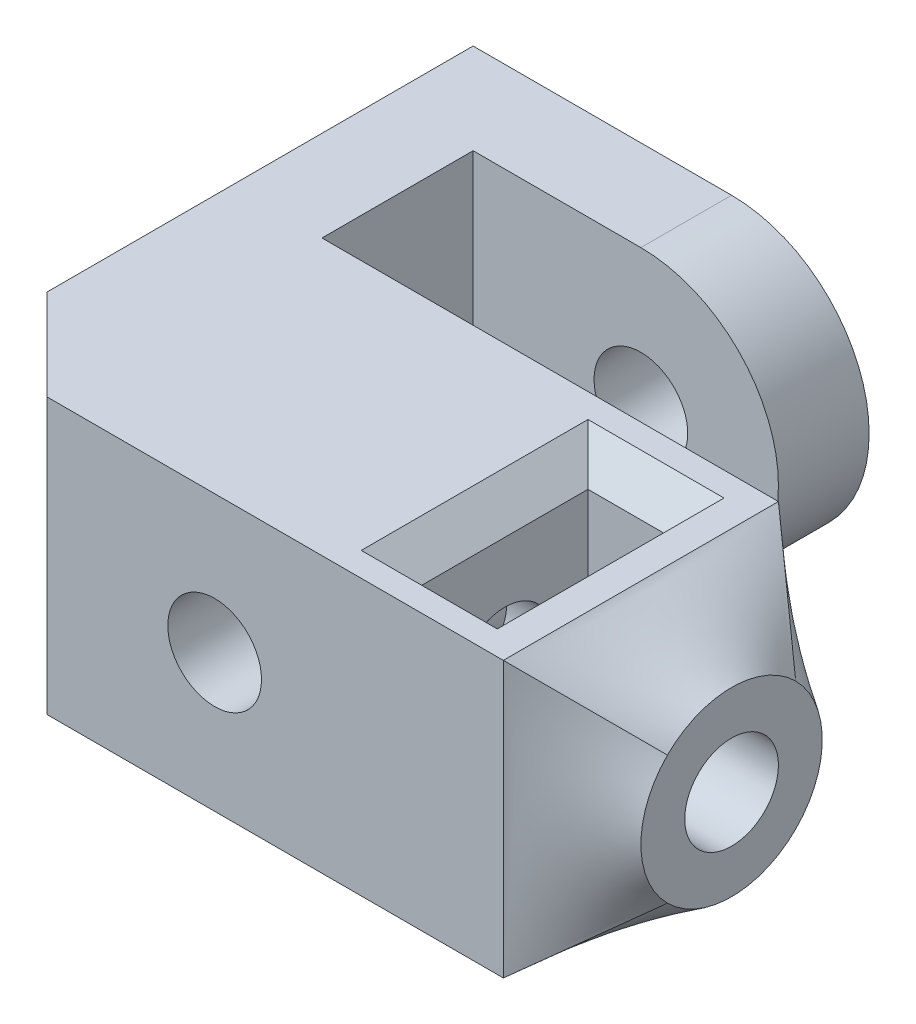
ISO-10303-21;
HEADER;
FILE_DESCRIPTION(('STEP AP214'),'2;1');
FILE_NAME('part.step','',(''),(''),'','','');
FILE_SCHEMA(('AUTOMOTIVE_DESIGN { 1 0 10303 214 1 1 1 1 }'));
ENDSEC;
DATA;
#1=APPLICATION_CONTEXT('core data for automotive mechanical design processes');
#2=APPLICATION_PROTOCOL_DEFINITION('international standard','automotive_design',2000,#1);
#3=PRODUCT_CONTEXT('',#1,'mechanical');
#4=PRODUCT('Part','Part','',(#3));
#5=PRODUCT_RELATED_PRODUCT_CATEGORY('part','',(#4));
#6=PRODUCT_DEFINITION_FORMATION('','',#4);
#7=PRODUCT_DEFINITION_CONTEXT('part definition',#1,'design');
#8=PRODUCT_DEFINITION('design','',#6,#7);
#9=PRODUCT_DEFINITION_SHAPE('','',#8);
#10=(LENGTH_UNIT() NAMED_UNIT(*) SI_UNIT(.MILLI.,.METRE.));
#11=(NAMED_UNIT(*) PLANE_ANGLE_UNIT() SI_UNIT($,.RADIAN.));
#12=(NAMED_UNIT(*) SI_UNIT($,.STERADIAN.) SOLID_ANGLE_UNIT());
#13=UNCERTAINTY_MEASURE_WITH_UNIT(LENGTH_MEASURE(1.E-05),#10,'distance_accuracy_value','');
#14=(GEOMETRIC_REPRESENTATION_CONTEXT(3) GLOBAL_UNCERTAINTY_ASSIGNED_CONTEXT((#13)) GLOBAL_UNIT_ASSIGNED_CONTEXT((#10,
#11,#12)) REPRESENTATION_CONTEXT('',''));
#15=CARTESIAN_POINT('',(0.,0.,0.));
#16=DIRECTION('',(0.,0.,1.));
#17=DIRECTION('',(1.,0.,0.));
#18=AXIS2_PLACEMENT_3D('',#15,#16,#17);
#19=CARTESIAN_POINT('',(-107.11518965689,2.50000000001586,4.55));
#20=DIRECTION('',(1.,0.,0.));
#21=DIRECTION('',(0.,0.,-1.));
#22=AXIS2_PLACEMENT_3D('',#19,#20,#21);
#23=CYLINDRICAL_SURFACE('',#22,1.55);
#24=CARTESIAN_POINT('',(-82.0141896568897,2.50000000001586,4.55));
#25=DIRECTION('',(1.,0.,0.));
#26=DIRECTION('',(0.,0.,-1.));
#27=AXIS2_PLACEMENT_3D('',#24,#25,#26);
#28=CIRCLE('',#27,1.55);
#29=CARTESIAN_POINT('',(-82.0141896568897,2.50000000001586,3.));
#30=VERTEX_POINT('',#29);
#31=EDGE_CURVE('E212',#30,#30,#28,.T.);
#32=ORIENTED_EDGE('',*,*,#31,.T.);
#33=EDGE_LOOP('',(#32));
#34=FACE_BOUND('',#33,.T.);
#35=CARTESIAN_POINT('',(-87.0141896568897,2.50000000001586,4.55));
#36=DIRECTION('',(-1.,0.,0.));
#37=DIRECTION('',(0.,0.,1.));
#38=AXIS2_PLACEMENT_3D('',#35,#36,#37);
#39=CIRCLE('',#38,1.55);
#40=CARTESIAN_POINT('',(-87.0141896568897,2.50000000001586,6.1));
#41=VERTEX_POINT('',#40);
#42=EDGE_CURVE('E289',#41,#41,#39,.T.);
#43=ORIENTED_EDGE('',*,*,#42,.T.);
#44=EDGE_LOOP('',(#43));
#45=FACE_BOUND('',#44,.T.);
#46=ADVANCED_FACE('F64',(#34,#45),#23,.F.);
#47=CARTESIAN_POINT('',(-100.11418965689,0.,0.));
#48=DIRECTION('',(-1.,0.,0.));
#49=DIRECTION('',(0.,0.,1.));
#50=AXIS2_PLACEMENT_3D('',#47,#48,#49);
#51=PLANE('',#50);
#52=DIRECTION('',(0.,1.,0.));
#53=VECTOR('',#52,1.);
#54=CARTESIAN_POINT('',(-100.11418965689,0.,-5.));
#55=LINE('',#54,#53);
#56=CARTESIAN_POINT('',(-100.11418965689,-2.04999999998414,-5.));
#57=VERTEX_POINT('',#56);
#58=CARTESIAN_POINT('',(-100.11418965689,7.05000000001586,-5.));
#59=VERTEX_POINT('',#58);
#60=EDGE_CURVE('E590',#57,#59,#55,.T.);
#61=ORIENTED_EDGE('',*,*,#60,.T.);
#62=DIRECTION('',(0.,0.,-1.));
#63=VECTOR('',#62,1.);
#64=CARTESIAN_POINT('',(-100.11418965689,7.05000000001586,-8.));
#65=LINE('',#64,#63);
#66=CARTESIAN_POINT('',(-100.11418965689,7.05000000001586,0.));
#67=VERTEX_POINT('',#66);
#68=EDGE_CURVE('E356',#67,#59,#65,.T.);
#69=ORIENTED_EDGE('',*,*,#68,.F.);
#70=DIRECTION('',(0.,-1.,0.));
#71=VECTOR('',#70,1.);
#72=CARTESIAN_POINT('',(-100.11418965689,0.,0.));
#73=LINE('',#72,#71);
#74=CARTESIAN_POINT('',(-100.11418965689,-2.04999999998414,0.));
#75=VERTEX_POINT('',#74);
#76=EDGE_CURVE('E544',#67,#75,#73,.T.);
#77=ORIENTED_EDGE('',*,*,#76,.T.);
#78=DIRECTION('',(0.,0.,1.));
#79=VECTOR('',#78,1.);
#80=CARTESIAN_POINT('',(-100.11418965689,-2.04999999998414,-8.));
#81=LINE('',#80,#79);
#82=EDGE_CURVE('E353',#57,#75,#81,.T.);
#83=ORIENTED_EDGE('',*,*,#82,.F.);
#84=EDGE_LOOP('',(#61,#69,#77,#83));
#85=FACE_BOUND('',#84,.T.);
#86=ADVANCED_FACE('F261',(#85),#51,.F.);
#87=CARTESIAN_POINT('',(0.,7.05000000001583,9.1));
#88=DIRECTION('',(0.,1.,0.));
#89=DIRECTION('',(-1.,0.,0.));
#90=AXIS2_PLACEMENT_3D('',#87,#88,#89);
#91=PLANE('',#90);
#92=DIRECTION('',(0.,0.,-1.));
#93=VECTOR('',#92,1.);
#94=CARTESIAN_POINT('',(-90.5141896568897,7.05000000001586,1.79999999999998));
#95=LINE('',#94,#93);
#96=CARTESIAN_POINT('',(-90.5141896568897,7.05000000001586,8.30000000000002));
#97=VERTEX_POINT('',#96);
#98=CARTESIAN_POINT('',(-90.5141896568897,7.05000000001586,0.799999999999976));
#99=VERTEX_POINT('',#98);
#100=EDGE_CURVE('E368',#97,#99,#95,.T.);
#101=ORIENTED_EDGE('',*,*,#100,.T.);
#102=DIRECTION('',(1.,0.,0.));
#103=VECTOR('',#102,1.);
#104=CARTESIAN_POINT('',(0.,7.05000000001583,0.799999999999976));
#105=LINE('',#104,#103);
#106=CARTESIAN_POINT('',(-86.0141896568897,7.05000000001586,0.799999999999976));
#107=VERTEX_POINT('',#106);
#108=EDGE_CURVE('E313',#99,#107,#105,.T.);
#109=ORIENTED_EDGE('',*,*,#108,.T.);
#110=DIRECTION('',(0.,0.,1.));
#111=VECTOR('',#110,1.);
#112=CARTESIAN_POINT('',(-86.0141896568897,7.05000000001586,9.1));
#113=LINE('',#112,#111);
#114=CARTESIAN_POINT('',(-86.0141896568897,7.05000000001586,8.30000000000002));
#115=VERTEX_POINT('',#114);
#116=EDGE_CURVE('E381',#107,#115,#113,.T.);
#117=ORIENTED_EDGE('',*,*,#116,.T.);
#118=DIRECTION('',(-1.,0.,0.));
#119=VECTOR('',#118,1.);
#120=CARTESIAN_POINT('',(0.,7.05000000001583,8.30000000000002));
#121=LINE('',#120,#119);
#122=EDGE_CURVE('E379',#115,#97,#121,.T.);
#123=ORIENTED_EDGE('',*,*,#122,.T.);
#124=EDGE_LOOP('',(#101,#109,#117,#123));
#125=FACE_BOUND('',#124,.T.);
#126=DIRECTION('',(0.,0.,-1.));
#127=VECTOR('',#126,1.);
#128=CARTESIAN_POINT('',(-103.11418965689,7.05000000001586,-8.));
#129=LINE('',#128,#127);
#130=CARTESIAN_POINT('',(-103.11418965689,7.05000000001586,6.09999999999998));
#131=VERTEX_POINT('',#130);
#132=CARTESIAN_POINT('',(-103.11418965689,7.05000000001586,-8.));
#133=VERTEX_POINT('',#132);
#134=EDGE_CURVE('E334',#131,#133,#129,.T.);
#135=ORIENTED_EDGE('',*,*,#134,.F.);
#136=DIRECTION('',(-0.707106781186548,0.,-0.707106781186547));
#137=VECTOR('',#136,1.);
#138=CARTESIAN_POINT('',(-50.0570948284447,7.05000000001585,59.1570948284448));
#139=LINE('',#138,#137);
#140=CARTESIAN_POINT('',(-100.11418965689,7.05000000001587,9.1));
#141=VERTEX_POINT('',#140);
#142=EDGE_CURVE('E86',#131,#141,#139,.F.);
#143=ORIENTED_EDGE('',*,*,#142,.T.);
#144=DIRECTION('',(1.,0.,0.));
#145=VECTOR('',#144,1.);
#146=CARTESIAN_POINT('',(0.,7.05000000001583,9.1));
#147=LINE('',#146,#145);
#148=CARTESIAN_POINT('',(-85.0141896568897,7.05000000001586,9.1));
#149=VERTEX_POINT('',#148);
#150=EDGE_CURVE('E360',#141,#149,#147,.T.);
#151=ORIENTED_EDGE('',*,*,#150,.T.);
#152=DIRECTION('',(0.,0.,1.));
#153=VECTOR('',#152,1.);
#154=CARTESIAN_POINT('',(-85.0141896568897,7.05000000001586,9.1));
#155=LINE('',#154,#153);
#156=CARTESIAN_POINT('',(-85.0141896568897,7.05000000001586,0.));
#157=VERTEX_POINT('',#156);
#158=EDGE_CURVE('E369',#149,#157,#155,.F.);
#159=ORIENTED_EDGE('',*,*,#158,.T.);
#160=DIRECTION('',(1.,0.,0.));
#161=VECTOR('',#160,1.);
#162=CARTESIAN_POINT('',(0.,7.05000000001583,0.));
#163=LINE('',#162,#161);
#164=EDGE_CURVE('E549',#67,#157,#163,.T.);
#165=ORIENTED_EDGE('',*,*,#164,.F.);
#166=ORIENTED_EDGE('',*,*,#68,.T.);
#167=DIRECTION('',(1.,0.,0.));
#168=VECTOR('',#167,1.);
#169=CARTESIAN_POINT('',(0.,7.05000000001586,-5.));
#170=LINE('',#169,#168);
#171=CARTESIAN_POINT('',(-94.5641896568897,7.05000000001586,-5.));
#172=VERTEX_POINT('',#171);
#173=EDGE_CURVE('E583',#59,#172,#170,.T.);
#174=ORIENTED_EDGE('',*,*,#173,.T.);
#175=DIRECTION('',(0.,0.,1.));
#176=VECTOR('',#175,1.);
#177=CARTESIAN_POINT('',(-94.5641896568897,7.05000000001586,-8.));
#178=LINE('',#177,#176);
#179=CARTESIAN_POINT('',(-94.5641896568897,7.05000000001586,-8.));
#180=VERTEX_POINT('',#179);
#181=EDGE_CURVE('E357',#180,#172,#178,.T.);
#182=ORIENTED_EDGE('',*,*,#181,.F.);
#183=DIRECTION('',(1.,0.,0.));
#184=VECTOR('',#183,1.);
#185=CARTESIAN_POINT('',(-103.11418965689,7.05000000001586,-8.));
#186=LINE('',#185,#184);
#187=EDGE_CURVE('E340',#133,#180,#186,.T.);
#188=ORIENTED_EDGE('',*,*,#187,.F.);
#189=EDGE_LOOP('',(#135,#143,#151,#159,#165,#166,#174,#182,#188));
#190=FACE_BOUND('',#189,.T.);
#191=ADVANCED_FACE('F266',(#125,#190),#91,.T.);
#192=CARTESIAN_POINT('',(0.,-2.04999999998411,9.1));
#193=DIRECTION('',(0.,1.,0.));
#194=DIRECTION('',(-1.,0.,0.));
#195=AXIS2_PLACEMENT_3D('',#192,#193,#194);
#196=PLANE('',#195);
#197=DIRECTION('',(1.,0.,0.));
#198=VECTOR('',#197,1.);
#199=CARTESIAN_POINT('',(0.,-2.04999999998411,9.1));
#200=LINE('',#199,#198);
#201=CARTESIAN_POINT('',(-100.11418965689,-2.04999999998414,9.1));
#202=VERTEX_POINT('',#201);
#203=CARTESIAN_POINT('',(-85.0141896568897,-2.04999999998414,9.1));
#204=VERTEX_POINT('',#203);
#205=EDGE_CURVE('E362',#202,#204,#200,.T.);
#206=ORIENTED_EDGE('',*,*,#205,.F.);
#207=DIRECTION('',(0.707106781186548,0.,0.707106781186547));
#208=VECTOR('',#207,1.);
#209=CARTESIAN_POINT('',(-103.11418965689,-2.04999999998414,6.09999999999999));
#210=LINE('',#209,#208);
#211=CARTESIAN_POINT('',(-103.11418965689,-2.04999999998414,6.09999999999999));
#212=VERTEX_POINT('',#211);
#213=EDGE_CURVE('E13',#202,#212,#210,.F.);
#214=ORIENTED_EDGE('',*,*,#213,.T.);
#215=DIRECTION('',(0.,0.,1.));
#216=VECTOR('',#215,1.);
#217=CARTESIAN_POINT('',(-103.11418965689,-2.04999999998414,-8.));
#218=LINE('',#217,#216);
#219=CARTESIAN_POINT('',(-103.11418965689,-2.04999999998414,-8.));
#220=VERTEX_POINT('',#219);
#221=EDGE_CURVE('E336',#220,#212,#218,.T.);
#222=ORIENTED_EDGE('',*,*,#221,.F.);
#223=DIRECTION('',(1.,0.,0.));
#224=VECTOR('',#223,1.);
#225=CARTESIAN_POINT('',(-103.11418965689,-2.04999999998414,-8.));
#226=LINE('',#225,#224);
#227=CARTESIAN_POINT('',(-94.5641896568897,-2.04999999998414,-8.));
#228=VERTEX_POINT('',#227);
#229=EDGE_CURVE('E343',#220,#228,#226,.T.);
#230=ORIENTED_EDGE('',*,*,#229,.T.);
#231=DIRECTION('',(0.,0.,1.));
#232=VECTOR('',#231,1.);
#233=CARTESIAN_POINT('',(-94.5641896568897,-2.04999999998414,-8.));
#234=LINE('',#233,#232);
#235=CARTESIAN_POINT('',(-94.5641896568897,-2.04999999998414,-5.));
#236=VERTEX_POINT('',#235);
#237=EDGE_CURVE('E582',#228,#236,#234,.T.);
#238=ORIENTED_EDGE('',*,*,#237,.T.);
#239=DIRECTION('',(-1.,0.,0.));
#240=VECTOR('',#239,1.);
#241=CARTESIAN_POINT('',(0.,-2.04999999998414,-5.));
#242=LINE('',#241,#240);
#243=EDGE_CURVE('E588',#236,#57,#242,.T.);
#244=ORIENTED_EDGE('',*,*,#243,.T.);
#245=ORIENTED_EDGE('',*,*,#82,.T.);
#246=DIRECTION('',(1.,0.,0.));
#247=VECTOR('',#246,1.);
#248=CARTESIAN_POINT('',(0.,-2.04999999998411,0.));
#249=LINE('',#248,#247);
#250=CARTESIAN_POINT('',(-85.0141896568897,-2.04999999998414,0.));
#251=VERTEX_POINT('',#250);
#252=EDGE_CURVE('E372',#75,#251,#249,.T.);
#253=ORIENTED_EDGE('',*,*,#252,.T.);
#254=DIRECTION('',(0.,0.,1.));
#255=VECTOR('',#254,1.);
#256=CARTESIAN_POINT('',(-85.0141896568897,-2.04999999998414,9.1));
#257=LINE('',#256,#255);
#258=EDGE_CURVE('E366',#204,#251,#257,.F.);
#259=ORIENTED_EDGE('',*,*,#258,.F.);
#260=EDGE_LOOP('',(#206,#214,#222,#230,#238,#244,#245,#253,#259));
#261=FACE_BOUND('',#260,.T.);
#262=ADVANCED_FACE('F407',(#261),#196,.F.);
#263=CARTESIAN_POINT('',(-94.5641896568897,2.50000000001586,9.1));
#264=DIRECTION('',(0.,0.,-1.));
#265=DIRECTION('',(-1.,0.,0.));
#266=AXIS2_PLACEMENT_3D('',#263,#264,#265);
#267=CYLINDRICAL_SURFACE('',#266,1.54999999999998);
#268=CARTESIAN_POINT('',(-94.5641896568897,2.50000000001586,9.1));
#269=DIRECTION('',(0.,0.,1.));
#270=DIRECTION('',(1.,0.,0.));
#271=AXIS2_PLACEMENT_3D('',#268,#269,#270);
#272=CIRCLE('',#271,1.54999999999998);
#273=CARTESIAN_POINT('',(-93.0141896568897,2.50000000001586,9.1));
#274=VERTEX_POINT('',#273);
#275=EDGE_CURVE('E375',#274,#274,#272,.T.);
#276=ORIENTED_EDGE('',*,*,#275,.T.);
#277=EDGE_LOOP('',(#276));
#278=FACE_BOUND('',#277,.T.);
#279=CARTESIAN_POINT('',(-94.5641896568897,2.50000000001586,0.));
#280=DIRECTION('',(0.,0.,1.));
#281=DIRECTION('',(1.,0.,0.));
#282=AXIS2_PLACEMENT_3D('',#279,#280,#281);
#283=CIRCLE('',#282,1.54999999999998);
#284=CARTESIAN_POINT('',(-93.0141896568897,2.50000000001586,0.));
#285=VERTEX_POINT('',#284);
#286=EDGE_CURVE('E363',#285,#285,#283,.T.);
#287=ORIENTED_EDGE('',*,*,#286,.F.);
#288=EDGE_LOOP('',(#287));
#289=FACE_BOUND('',#288,.T.);
#290=ADVANCED_FACE('F410',(#278,#289),#267,.F.);
#291=CARTESIAN_POINT('',(0.,0.,9.1));
#292=DIRECTION('',(0.,0.,1.));
#293=DIRECTION('',(1.,0.,0.));
#294=AXIS2_PLACEMENT_3D('',#291,#292,#293);
#295=PLANE('',#294);
#296=ORIENTED_EDGE('',*,*,#150,.F.);
#297=DIRECTION('',(0.,-1.,0.));
#298=VECTOR('',#297,1.);
#299=CARTESIAN_POINT('',(-100.11418965689,0.,9.1));
#300=LINE('',#299,#298);
#301=EDGE_CURVE('E72',#141,#202,#300,.T.);
#302=ORIENTED_EDGE('',*,*,#301,.T.);
#303=ORIENTED_EDGE('',*,*,#205,.T.);
#304=DIRECTION('',(0.,1.,0.));
#305=VECTOR('',#304,1.);
#306=CARTESIAN_POINT('',(-85.0141896568897,0.,9.1));
#307=LINE('',#306,#305);
#308=EDGE_CURVE('E365',#204,#149,#307,.T.);
#309=ORIENTED_EDGE('',*,*,#308,.T.);
#310=EDGE_LOOP('',(#296,#302,#303,#309));
#311=FACE_BOUND('',#310,.T.);
#312=ORIENTED_EDGE('',*,*,#275,.F.);
#313=EDGE_LOOP('',(#312));
#314=FACE_BOUND('',#313,.T.);
#315=ADVANCED_FACE('F414',(#311,#314),#295,.T.);
#316=CARTESIAN_POINT('',(0.,0.,0.));
#317=DIRECTION('',(0.,0.,1.));
#318=DIRECTION('',(1.,0.,0.));
#319=AXIS2_PLACEMENT_3D('',#316,#317,#318);
#320=PLANE('',#319);
#321=ORIENTED_EDGE('',*,*,#164,.T.);
#322=DIRECTION('',(0.,1.,0.));
#323=VECTOR('',#322,1.);
#324=CARTESIAN_POINT('',(-85.0141896568897,0.,0.));
#325=LINE('',#324,#323);
#326=EDGE_CURVE('E370',#251,#157,#325,.T.);
#327=ORIENTED_EDGE('',*,*,#326,.F.);
#328=ORIENTED_EDGE('',*,*,#252,.F.);
#329=ORIENTED_EDGE('',*,*,#76,.F.);
#330=EDGE_LOOP('',(#321,#327,#328,#329));
#331=FACE_BOUND('',#330,.T.);
#332=ORIENTED_EDGE('',*,*,#286,.T.);
#333=EDGE_LOOP('',(#332));
#334=FACE_BOUND('',#333,.T.);
#335=ADVANCED_FACE('F416',(#331,#334),#320,.F.);
#336=CARTESIAN_POINT('',(-103.11418965689,7.05000000001586,-8.));
#337=DIRECTION('',(0.,0.,1.));
#338=DIRECTION('',(0.,-1.,0.));
#339=AXIS2_PLACEMENT_3D('',#336,#337,#338);
#340=PLANE('',#339);
#341=ORIENTED_EDGE('',*,*,#187,.T.);
#342=CARTESIAN_POINT('',(-94.5641896568897,2.50000000001586,-8.));
#343=DIRECTION('',(0.,0.,-1.));
#344=DIRECTION('',(-1.,0.,0.));
#345=AXIS2_PLACEMENT_3D('',#342,#343,#344);
#346=CIRCLE('',#345,4.55);
#347=EDGE_CURVE('E570',#180,#228,#346,.T.);
#348=ORIENTED_EDGE('',*,*,#347,.T.);
#349=ORIENTED_EDGE('',*,*,#229,.F.);
#350=DIRECTION('',(0.,-1.,0.));
#351=VECTOR('',#350,1.);
#352=CARTESIAN_POINT('',(-103.11418965689,7.05000000001586,-8.));
#353=LINE('',#352,#351);
#354=EDGE_CURVE('E345',#133,#220,#353,.T.);
#355=ORIENTED_EDGE('',*,*,#354,.F.);
#356=EDGE_LOOP('',(#341,#348,#349,#355));
#357=FACE_BOUND('',#356,.T.);
#358=CARTESIAN_POINT('',(-94.5641896568897,2.50000000001586,-8.));
#359=DIRECTION('',(0.,0.,-1.));
#360=DIRECTION('',(-1.,0.,0.));
#361=AXIS2_PLACEMENT_3D('',#358,#359,#360);
#362=CIRCLE('',#361,1.54999999999998);
#363=CARTESIAN_POINT('',(-96.1141896568897,2.50000000001586,-8.));
#364=VERTEX_POINT('',#363);
#365=EDGE_CURVE('E578',#364,#364,#362,.T.);
#366=ORIENTED_EDGE('',*,*,#365,.F.);
#367=EDGE_LOOP('',(#366));
#368=FACE_BOUND('',#367,.T.);
#369=ADVANCED_FACE('F419',(#357,#368),#340,.F.);
#370=CARTESIAN_POINT('',(-103.11418965689,0.,0.));
#371=DIRECTION('',(-1.,0.,0.));
#372=DIRECTION('',(0.,0.,1.));
#373=AXIS2_PLACEMENT_3D('',#370,#371,#372);
#374=PLANE('',#373);
#375=ORIENTED_EDGE('',*,*,#221,.T.);
#376=DIRECTION('',(0.,1.,0.));
#377=VECTOR('',#376,1.);
#378=CARTESIAN_POINT('',(-103.11418965689,0.,6.09999999999999));
#379=LINE('',#378,#377);
#380=EDGE_CURVE('E318',#212,#131,#379,.T.);
#381=ORIENTED_EDGE('',*,*,#380,.T.);
#382=ORIENTED_EDGE('',*,*,#134,.T.);
#383=ORIENTED_EDGE('',*,*,#354,.T.);
#384=EDGE_LOOP('',(#375,#381,#382,#383));
#385=FACE_BOUND('',#384,.T.);
#386=ADVANCED_FACE('F332',(#385),#374,.T.);
#387=CARTESIAN_POINT('',(-94.5641896568897,2.50000000001586,-8.));
#388=DIRECTION('',(0.,0.,1.));
#389=DIRECTION('',(1.,0.,0.));
#390=AXIS2_PLACEMENT_3D('',#387,#388,#389);
#391=CYLINDRICAL_SURFACE('',#390,4.55);
#392=CARTESIAN_POINT('',(-94.5641896568897,2.50000000001586,-5.));
#393=DIRECTION('',(0.,0.,-1.));
#394=DIRECTION('',(-1.,0.,0.));
#395=AXIS2_PLACEMENT_3D('',#392,#393,#394);
#396=CIRCLE('',#395,4.55);
#397=EDGE_CURVE('E586',#172,#236,#396,.T.);
#398=ORIENTED_EDGE('',*,*,#397,.T.);
#399=ORIENTED_EDGE('',*,*,#237,.F.);
#400=ORIENTED_EDGE('',*,*,#347,.F.);
#401=ORIENTED_EDGE('',*,*,#181,.T.);
#402=EDGE_LOOP('',(#398,#399,#400,#401));
#403=FACE_BOUND('',#402,.T.);
#404=ADVANCED_FACE('F428',(#403),#391,.T.);
#405=CARTESIAN_POINT('',(-94.5641896568897,2.50000000001586,-8.));
#406=DIRECTION('',(0.,0.,1.));
#407=DIRECTION('',(1.,0.,0.));
#408=AXIS2_PLACEMENT_3D('',#405,#406,#407);
#409=CYLINDRICAL_SURFACE('',#408,1.54999999999998);
#410=ORIENTED_EDGE('',*,*,#365,.T.);
#411=EDGE_LOOP('',(#410));
#412=FACE_BOUND('',#411,.T.);
#413=CARTESIAN_POINT('',(-94.5641896568897,2.50000000001586,-5.));
#414=DIRECTION('',(0.,0.,-1.));
#415=DIRECTION('',(-1.,0.,0.));
#416=AXIS2_PLACEMENT_3D('',#413,#414,#415);
#417=CIRCLE('',#416,1.54999999999998);
#418=CARTESIAN_POINT('',(-96.1141896568897,2.50000000001586,-5.));
#419=VERTEX_POINT('',#418);
#420=EDGE_CURVE('E579',#419,#419,#417,.T.);
#421=ORIENTED_EDGE('',*,*,#420,.F.);
#422=EDGE_LOOP('',(#421));
#423=FACE_BOUND('',#422,.T.);
#424=ADVANCED_FACE('F431',(#412,#423),#409,.F.);
#425=CARTESIAN_POINT('',(0.,0.,-5.));
#426=DIRECTION('',(0.,0.,-1.));
#427=DIRECTION('',(-1.,0.,0.));
#428=AXIS2_PLACEMENT_3D('',#425,#426,#427);
#429=PLANE('',#428);
#430=ORIENTED_EDGE('',*,*,#173,.F.);
#431=ORIENTED_EDGE('',*,*,#60,.F.);
#432=ORIENTED_EDGE('',*,*,#243,.F.);
#433=ORIENTED_EDGE('',*,*,#397,.F.);
#434=EDGE_LOOP('',(#430,#431,#432,#433));
#435=FACE_BOUND('',#434,.T.);
#436=ORIENTED_EDGE('',*,*,#420,.T.);
#437=EDGE_LOOP('',(#436));
#438=FACE_BOUND('',#437,.T.);
#439=ADVANCED_FACE('F435',(#435,#438),#429,.F.);
#440=CARTESIAN_POINT('',(-82.0141896568897,2.50000000001586,4.55));
#441=DIRECTION('',(1.,0.,0.));
#442=DIRECTION('',(0.,0.,-1.));
#443=AXIS2_PLACEMENT_3D('',#440,#441,#442);
#444=PLANE('',#443);
#445=ORIENTED_EDGE('',*,*,#31,.F.);
#446=EDGE_LOOP('',(#445));
#447=FACE_BOUND('',#446,.T.);
#448=CARTESIAN_POINT('',(-82.0141896568897,2.50000000001586,4.55));
#449=DIRECTION('',(1.,0.,0.));
#450=DIRECTION('',(0.,0.,-1.));
#451=AXIS2_PLACEMENT_3D('',#448,#449,#450);
#452=CIRCLE('',#451,3.);
#453=CARTESIAN_POINT('',(-82.0141896568897,0.378679656456218,2.42867965644036));
#454=VERTEX_POINT('',#453);
#455=CARTESIAN_POINT('',(-82.0141896568897,4.6213203435755,2.42867965644036));
#456=VERTEX_POINT('',#455);
#457=EDGE_CURVE('E474',#454,#456,#452,.T.);
#458=ORIENTED_EDGE('',*,*,#457,.T.);
#459=CARTESIAN_POINT('',(-82.0141896568897,4.6213203435755,6.67132034355964));
#460=VERTEX_POINT('',#459);
#461=EDGE_CURVE('E552',#456,#460,#452,.T.);
#462=ORIENTED_EDGE('',*,*,#461,.T.);
#463=CARTESIAN_POINT('',(-82.0141896568897,0.378679656456219,6.67132034355964));
#464=VERTEX_POINT('',#463);
#465=EDGE_CURVE('E556',#460,#464,#452,.T.);
#466=ORIENTED_EDGE('',*,*,#465,.T.);
#467=EDGE_CURVE('E520',#464,#454,#452,.T.);
#468=ORIENTED_EDGE('',*,*,#467,.T.);
#469=EDGE_LOOP('',(#458,#462,#466,#468));
#470=FACE_BOUND('',#469,.T.);
#471=ADVANCED_FACE('F439',(#447,#470),#444,.T.);
#472=CARTESIAN_POINT('',(-85.0141896568897,-2.04999999998414,9.1));
#473=CARTESIAN_POINT('',(-82.0141896568897,0.378679656456219,6.67132034355964));
#474=CARTESIAN_POINT('',(-85.0141896568897,-2.04999999998414,8.34166666666667));
#475=CARTESIAN_POINT('',(-82.0141896568897,0.128679656456219,6.42132034355964));
#476=CARTESIAN_POINT('',(-85.0141896568897,-2.04999999998414,7.58333333333334));
#477=CARTESIAN_POINT('',(-82.0141896568897,-0.0954757886155108,6.10603832728978));
#478=CARTESIAN_POINT('',(-85.0141896568897,-2.04999999998414,6.06666666666667));
#479=CARTESIAN_POINT('',(-82.0141896568897,-0.410975479348306,5.37702575770465));
#480=CARTESIAN_POINT('',(-85.0141896568897,-2.04999999998414,5.30833333333334));
#481=CARTESIAN_POINT('',(-82.0141896568897,-0.499999999984139,4.9642135623731));
#482=CARTESIAN_POINT('',(-85.0141896568897,-2.04999999998414,3.79166666666667));
#483=CARTESIAN_POINT('',(-82.0141896568897,-0.49999999998414,4.13578643762691));
#484=CARTESIAN_POINT('',(-85.0141896568897,-2.04999999998414,3.03333333333334));
#485=CARTESIAN_POINT('',(-82.0141896568897,-0.410975479348307,3.72297424229535));
#486=CARTESIAN_POINT('',(-85.0141896568897,-2.04999999998414,1.51666666666667));
#487=CARTESIAN_POINT('',(-82.0141896568897,-0.095475788615512,2.99396167271023));
#488=CARTESIAN_POINT('',(-85.0141896568897,-2.04999999998414,0.758333333333336));
#489=CARTESIAN_POINT('',(-82.0141896568897,0.128679656456218,2.67867965644036));
#490=CARTESIAN_POINT('',(-85.0141896568897,-2.04999999998414,0.));
#491=CARTESIAN_POINT('',(-82.0141896568897,0.378679656456218,2.42867965644036));
#492=B_SPLINE_SURFACE_WITH_KNOTS('',3,1,((#472,#473),(#474,#475),(#476,#477),(#478,#479),(#480,
#481),(#482,#483),(#484,#485),(#486,#487),(#488,#489),(#490,#491)),.UNSPECIFIED.,.F.,.F.,.F.,(4,
2,2,2,4),(2,2),(0.,0.25,0.5,0.75,1.),(0.,1.),.UNSPECIFIED.);
#493=DIRECTION('',(0.657841435116081,0.532562036876651,0.532562036876651));
#494=VECTOR('',#493,1.);
#495=CARTESIAN_POINT('',(-83.5141896568897,-0.835660171763959,1.21433982822018));
#496=LINE('',#495,#494);
#497=EDGE_CURVE('E533',#251,#454,#496,.T.);
#498=DIRECTION('',(-0.657841435116081,-0.532562036876651,0.532562036876651));
#499=VECTOR('',#498,1.);
#500=CARTESIAN_POINT('',(-83.5141896568897,-0.835660171763959,7.88566017177982));
#501=LINE('',#500,#499);
#502=EDGE_CURVE('E530',#464,#204,#501,.T.);
#503=ORIENTED_EDGE('',*,*,#258,.T.);
#504=ORIENTED_EDGE('',*,*,#497,.T.);
#505=ORIENTED_EDGE('',*,*,#467,.F.);
#506=ORIENTED_EDGE('',*,*,#502,.T.);
#507=EDGE_LOOP('',(#503,#504,#505,#506));
#508=FACE_BOUND('',#507,.T.);
#509=ADVANCED_FACE('F492',(#508),#492,.T.);
#510=CARTESIAN_POINT('',(-85.0141896568897,-2.04999999998414,0.));
#511=CARTESIAN_POINT('',(-82.0141896568897,0.378679656456218,2.42867965644036));
#512=CARTESIAN_POINT('',(-85.0141896568897,-1.2916666666508,0.));
#513=CARTESIAN_POINT('',(-82.0141896568897,0.628679656456218,2.17867965644036));
#514=CARTESIAN_POINT('',(-85.0141896568897,-0.533333333317469,0.));
#515=CARTESIAN_POINT('',(-82.0141896568897,0.943961672726088,1.95452421136863));
#516=CARTESIAN_POINT('',(-85.0141896568897,0.983333333349198,0.));
#517=CARTESIAN_POINT('',(-82.0141896568897,1.67297424231121,1.63902452063583));
#518=CARTESIAN_POINT('',(-85.0141896568897,1.74166666668253,0.));
#519=CARTESIAN_POINT('',(-82.0141896568897,2.08578643764277,1.55));
#520=CARTESIAN_POINT('',(-85.0141896568897,3.2583333333492,0.));
#521=CARTESIAN_POINT('',(-82.0141896568897,2.91421356238896,1.55));
#522=CARTESIAN_POINT('',(-85.0141896568897,4.01666666668253,0.));
#523=CARTESIAN_POINT('',(-82.0141896568897,3.32702575772051,1.63902452063583));
#524=CARTESIAN_POINT('',(-85.0141896568897,5.5333333333492,0.));
#525=CARTESIAN_POINT('',(-82.0141896568898,4.05603832730563,1.95452421136863));
#526=CARTESIAN_POINT('',(-85.0141896568897,6.29166666668253,0.));
#527=CARTESIAN_POINT('',(-82.0141896568897,4.3713203435755,2.17867965644036));
#528=CARTESIAN_POINT('',(-85.0141896568897,7.05000000001586,0.));
#529=CARTESIAN_POINT('',(-82.0141896568897,4.6213203435755,2.42867965644036));
#530=B_SPLINE_SURFACE_WITH_KNOTS('',3,1,((#510,#511),(#512,#513),(#514,#515),(#516,#517),(#518,
#519),(#520,#521),(#522,#523),(#524,#525),(#526,#527),(#528,#529)),.UNSPECIFIED.,.F.,.F.,.F.,(4,
2,2,2,4),(2,2),(0.,0.25,0.5,0.75,1.),(0.,1.),.UNSPECIFIED.);
#531=DIRECTION('',(0.657841435116081,-0.532562036876651,0.532562036876651));
#532=VECTOR('',#531,1.);
#533=CARTESIAN_POINT('',(-83.5141896568897,5.83566017179568,1.21433982822018));
#534=LINE('',#533,#532);
#535=EDGE_CURVE('E526',#157,#456,#534,.T.);
#536=ORIENTED_EDGE('',*,*,#326,.T.);
#537=ORIENTED_EDGE('',*,*,#535,.T.);
#538=ORIENTED_EDGE('',*,*,#457,.F.);
#539=ORIENTED_EDGE('',*,*,#497,.F.);
#540=EDGE_LOOP('',(#536,#537,#538,#539));
#541=FACE_BOUND('',#540,.T.);
#542=ADVANCED_FACE('F481',(#541),#530,.T.);
#543=CARTESIAN_POINT('',(-85.0141896568897,7.05000000001586,9.1));
#544=CARTESIAN_POINT('',(-82.0141896568897,4.6213203435755,6.67132034355964));
#545=CARTESIAN_POINT('',(-85.0141896568897,6.29166666668253,9.1));
#546=CARTESIAN_POINT('',(-82.0141896568897,4.3713203435755,6.92132034355964));
#547=CARTESIAN_POINT('',(-85.0141896568897,5.5333333333492,9.1));
#548=CARTESIAN_POINT('',(-82.0141896568897,4.05603832730563,7.14547578863137));
#549=CARTESIAN_POINT('',(-85.0141896568897,4.01666666668253,9.1));
#550=CARTESIAN_POINT('',(-82.0141896568897,3.32702575772051,7.46097547936417));
#551=CARTESIAN_POINT('',(-85.0141896568897,3.2583333333492,9.1));
#552=CARTESIAN_POINT('',(-82.0141896568897,2.91421356238896,7.55));
#553=CARTESIAN_POINT('',(-85.0141896568897,1.74166666668253,9.1));
#554=CARTESIAN_POINT('',(-82.0141896568897,2.08578643764277,7.55));
#555=CARTESIAN_POINT('',(-85.0141896568897,0.983333333349201,9.1));
#556=CARTESIAN_POINT('',(-82.0141896568897,1.67297424231121,7.46097547936417));
#557=CARTESIAN_POINT('',(-85.0141896568897,-0.533333333317467,9.1));
#558=CARTESIAN_POINT('',(-82.0141896568897,0.943961672726089,7.14547578863137));
#559=CARTESIAN_POINT('',(-85.0141896568897,-1.2916666666508,9.1));
#560=CARTESIAN_POINT('',(-82.0141896568897,0.628679656456219,6.92132034355964));
#561=CARTESIAN_POINT('',(-85.0141896568897,-2.04999999998414,9.1));
#562=CARTESIAN_POINT('',(-82.0141896568897,0.378679656456219,6.67132034355964));
#563=B_SPLINE_SURFACE_WITH_KNOTS('',3,1,((#543,#544),(#545,#546),(#547,#548),(#549,#550),(#551,
#552),(#553,#554),(#555,#556),(#557,#558),(#559,#560),(#561,#562)),.UNSPECIFIED.,.F.,.F.,.F.,(4,
2,2,2,4),(2,2),(0.,0.25,0.5,0.75,1.),(0.,1.),.UNSPECIFIED.);
#564=DIRECTION('',(0.657841435116081,-0.532562036876651,-0.532562036876651));
#565=VECTOR('',#564,1.);
#566=CARTESIAN_POINT('',(-83.5141896568897,5.83566017179568,7.88566017177982));
#567=LINE('',#566,#565);
#568=EDGE_CURVE('E227',#149,#460,#567,.T.);
#569=ORIENTED_EDGE('',*,*,#308,.F.);
#570=ORIENTED_EDGE('',*,*,#502,.F.);
#571=ORIENTED_EDGE('',*,*,#465,.F.);
#572=ORIENTED_EDGE('',*,*,#568,.F.);
#573=EDGE_LOOP('',(#569,#570,#571,#572));
#574=FACE_BOUND('',#573,.T.);
#575=ADVANCED_FACE('F446',(#574),#563,.T.);
#576=CARTESIAN_POINT('',(-85.0141896568897,7.05000000001586,0.));
#577=CARTESIAN_POINT('',(-82.0141896568897,4.6213203435755,2.42867965644036));
#578=CARTESIAN_POINT('',(-85.0141896568897,7.05000000001586,0.758333333333333));
#579=CARTESIAN_POINT('',(-82.0141896568897,4.8713203435755,2.67867965644036));
#580=CARTESIAN_POINT('',(-85.0141896568897,7.05000000001586,1.51666666666667));
#581=CARTESIAN_POINT('',(-82.0141896568897,5.09547578864724,2.99396167271023));
#582=CARTESIAN_POINT('',(-85.0141896568897,7.05000000001586,3.03333333333333));
#583=CARTESIAN_POINT('',(-82.0141896568897,5.41097547938003,3.72297424229535));
#584=CARTESIAN_POINT('',(-85.0141896568897,7.05000000001586,3.79166666666667));
#585=CARTESIAN_POINT('',(-82.0141896568897,5.50000000001586,4.13578643762691));
#586=CARTESIAN_POINT('',(-85.0141896568897,7.05000000001586,5.30833333333333));
#587=CARTESIAN_POINT('',(-82.0141896568897,5.50000000001586,4.9642135623731));
#588=CARTESIAN_POINT('',(-85.0141896568897,7.05000000001586,6.06666666666667));
#589=CARTESIAN_POINT('',(-82.0141896568897,5.41097547938003,5.37702575770466));
#590=CARTESIAN_POINT('',(-85.0141896568897,7.05000000001586,7.58333333333333));
#591=CARTESIAN_POINT('',(-82.0141896568897,5.09547578864724,6.10603832728978));
#592=CARTESIAN_POINT('',(-85.0141896568897,7.05000000001586,8.34166666666667));
#593=CARTESIAN_POINT('',(-82.0141896568897,4.8713203435755,6.42132034355964));
#594=CARTESIAN_POINT('',(-85.0141896568897,7.05000000001586,9.1));
#595=CARTESIAN_POINT('',(-82.0141896568897,4.6213203435755,6.67132034355964));
#596=B_SPLINE_SURFACE_WITH_KNOTS('',3,1,((#576,#577),(#578,#579),(#580,#581),(#582,#583),(#584,
#585),(#586,#587),(#588,#589),(#590,#591),(#592,#593),(#594,#595)),.UNSPECIFIED.,.F.,.F.,.F.,(4,
2,2,2,4),(2,2),(0.,0.25,0.5,0.75,1.),(0.,1.),.UNSPECIFIED.);
#597=ORIENTED_EDGE('',*,*,#158,.F.);
#598=ORIENTED_EDGE('',*,*,#568,.T.);
#599=ORIENTED_EDGE('',*,*,#461,.F.);
#600=ORIENTED_EDGE('',*,*,#535,.F.);
#601=EDGE_LOOP('',(#597,#598,#599,#600));
#602=FACE_BOUND('',#601,.T.);
#603=ADVANCED_FACE('F241',(#602),#596,.T.);
#604=CARTESIAN_POINT('',(-89.5141896568897,1.46363793321427,0.845031754737406));
#605=DIRECTION('',(0.,0.866025403784439,0.5));
#606=DIRECTION('',(0.,-0.5,0.866025403784439));
#607=AXIS2_PLACEMENT_3D('',#604,#605,#606);
#608=PLANE('',#607);
#609=DIRECTION('',(0.,-0.5,0.866025403784439));
#610=VECTOR('',#609,1.);
#611=CARTESIAN_POINT('',(-87.0141896568897,1.46363793321427,0.845031754737406));
#612=LINE('',#611,#610);
#613=CARTESIAN_POINT('',(-87.0141896568897,0.912286759744378,1.79999999999998));
#614=VERTEX_POINT('',#613);
#615=CARTESIAN_POINT('',(-87.0141896568897,-0.675426480527105,4.55));
#616=VERTEX_POINT('',#615);
#617=EDGE_CURVE('E292',#614,#616,#612,.T.);
#618=ORIENTED_EDGE('',*,*,#617,.F.);
#619=DIRECTION('',(1.,0.,0.));
#620=VECTOR('',#619,1.);
#621=CARTESIAN_POINT('',(-89.5141896568897,0.912286759744378,1.79999999999998));
#622=LINE('',#621,#620);
#623=CARTESIAN_POINT('',(-89.5141896568897,0.912286759744378,1.79999999999998));
#624=VERTEX_POINT('',#623);
#625=EDGE_CURVE('E207',#624,#614,#622,.T.);
#626=ORIENTED_EDGE('',*,*,#625,.F.);
#627=DIRECTION('',(0.,-0.5,0.866025403784439));
#628=VECTOR('',#627,1.);
#629=CARTESIAN_POINT('',(-89.5141896568897,1.46363793321427,0.845031754737406));
#630=LINE('',#629,#628);
#631=CARTESIAN_POINT('',(-89.5141896568897,-0.675426480527105,4.55));
#632=VERTEX_POINT('',#631);
#633=EDGE_CURVE('E191',#624,#632,#630,.T.);
#634=ORIENTED_EDGE('',*,*,#633,.T.);
#635=DIRECTION('',(1.,0.,0.));
#636=VECTOR('',#635,1.);
#637=CARTESIAN_POINT('',(-89.5141896568897,-0.675426480527105,4.55));
#638=LINE('',#637,#636);
#639=EDGE_CURVE('E204',#632,#616,#638,.T.);
#640=ORIENTED_EDGE('',*,*,#639,.T.);
#641=EDGE_LOOP('',(#618,#626,#634,#640));
#642=FACE_BOUND('',#641,.T.);
#643=ADVANCED_FACE('F203',(#642),#608,.T.);
#644=CARTESIAN_POINT('',(-89.5141896568897,-2.47677765400493,1.42996824526259));
#645=DIRECTION('',(0.,0.866025403784439,-0.5));
#646=DIRECTION('',(0.,0.5,0.866025403784439));
#647=AXIS2_PLACEMENT_3D('',#644,#645,#646);
#648=PLANE('',#647);
#649=DIRECTION('',(0.,0.5,0.866025403784439));
#650=VECTOR('',#649,1.);
#651=CARTESIAN_POINT('',(-87.0141896568897,-2.47677765400493,1.42996824526259));
#652=LINE('',#651,#650);
#653=CARTESIAN_POINT('',(-87.0141896568897,0.912286759744378,7.30000000000002));
#654=VERTEX_POINT('',#653);
#655=EDGE_CURVE('E211',#616,#654,#652,.T.);
#656=ORIENTED_EDGE('',*,*,#655,.F.);
#657=ORIENTED_EDGE('',*,*,#639,.F.);
#658=DIRECTION('',(0.,0.5,0.866025403784439));
#659=VECTOR('',#658,1.);
#660=CARTESIAN_POINT('',(-89.5141896568897,-2.47677765400493,1.42996824526259));
#661=LINE('',#660,#659);
#662=CARTESIAN_POINT('',(-89.5141896568897,0.912286759744378,7.30000000000002));
#663=VERTEX_POINT('',#662);
#664=EDGE_CURVE('E187',#632,#663,#661,.T.);
#665=ORIENTED_EDGE('',*,*,#664,.T.);
#666=DIRECTION('',(1.,0.,0.));
#667=VECTOR('',#666,1.);
#668=CARTESIAN_POINT('',(-89.5141896568897,0.912286759744378,7.30000000000002));
#669=LINE('',#668,#667);
#670=EDGE_CURVE('E213',#663,#654,#669,.T.);
#671=ORIENTED_EDGE('',*,*,#670,.T.);
#672=EDGE_LOOP('',(#656,#657,#665,#671));
#673=FACE_BOUND('',#672,.T.);
#674=ADVANCED_FACE('F210',(#673),#648,.T.);
#675=CARTESIAN_POINT('',(-89.5141896568897,0.,7.30000000000002));
#676=DIRECTION('',(0.,0.,-1.));
#677=DIRECTION('',(-1.,0.,0.));
#678=AXIS2_PLACEMENT_3D('',#675,#676,#677);
#679=PLANE('',#678);
#680=DIRECTION('',(0.,1.,0.));
#681=VECTOR('',#680,1.);
#682=CARTESIAN_POINT('',(-89.5141896568897,0.,7.30000000000002));
#683=LINE('',#682,#681);
#684=CARTESIAN_POINT('',(-89.5141896568897,6.05000000001587,7.30000000000002));
#685=VERTEX_POINT('',#684);
#686=EDGE_CURVE('E193',#663,#685,#683,.T.);
#687=ORIENTED_EDGE('',*,*,#686,.T.);
#688=DIRECTION('',(1.,0.,0.));
#689=VECTOR('',#688,1.);
#690=CARTESIAN_POINT('',(-89.5141896568897,6.05000000001587,7.30000000000002));
#691=LINE('',#690,#689);
#692=CARTESIAN_POINT('',(-87.0141896568897,6.05000000001587,7.30000000000002));
#693=VERTEX_POINT('',#692);
#694=EDGE_CURVE('E308',#685,#693,#691,.T.);
#695=ORIENTED_EDGE('',*,*,#694,.T.);
#696=DIRECTION('',(0.,1.,0.));
#697=VECTOR('',#696,1.);
#698=CARTESIAN_POINT('',(-87.0141896568897,0.,7.30000000000002));
#699=LINE('',#698,#697);
#700=EDGE_CURVE('E283',#654,#693,#699,.T.);
#701=ORIENTED_EDGE('',*,*,#700,.F.);
#702=ORIENTED_EDGE('',*,*,#670,.F.);
#703=EDGE_LOOP('',(#687,#695,#701,#702));
#704=FACE_BOUND('',#703,.T.);
#705=ADVANCED_FACE('F244',(#704),#679,.T.);
#706=CARTESIAN_POINT('',(-89.5141896568897,0.,1.79999999999998));
#707=DIRECTION('',(0.,0.,1.));
#708=DIRECTION('',(0.,-1.,0.));
#709=AXIS2_PLACEMENT_3D('',#706,#707,#708);
#710=PLANE('',#709);
#711=DIRECTION('',(0.,-1.,0.));
#712=VECTOR('',#711,1.);
#713=CARTESIAN_POINT('',(-87.0141896568897,0.,1.79999999999998));
#714=LINE('',#713,#712);
#715=CARTESIAN_POINT('',(-87.0141896568897,6.05000000001587,1.79999999999998));
#716=VERTEX_POINT('',#715);
#717=EDGE_CURVE('E281',#716,#614,#714,.T.);
#718=ORIENTED_EDGE('',*,*,#717,.F.);
#719=DIRECTION('',(-1.,0.,0.));
#720=VECTOR('',#719,1.);
#721=CARTESIAN_POINT('',(-89.5141896568897,6.05000000001587,1.79999999999998));
#722=LINE('',#721,#720);
#723=CARTESIAN_POINT('',(-89.5141896568897,6.05000000001587,1.79999999999998));
#724=VERTEX_POINT('',#723);
#725=EDGE_CURVE('E309',#716,#724,#722,.T.);
#726=ORIENTED_EDGE('',*,*,#725,.T.);
#727=DIRECTION('',(0.,-1.,0.));
#728=VECTOR('',#727,1.);
#729=CARTESIAN_POINT('',(-89.5141896568897,0.,1.79999999999998));
#730=LINE('',#729,#728);
#731=EDGE_CURVE('E287',#724,#624,#730,.T.);
#732=ORIENTED_EDGE('',*,*,#731,.T.);
#733=ORIENTED_EDGE('',*,*,#625,.T.);
#734=EDGE_LOOP('',(#718,#726,#732,#733));
#735=FACE_BOUND('',#734,.T.);
#736=ADVANCED_FACE('F247',(#735),#710,.T.);
#737=CARTESIAN_POINT('',(-89.5141896568897,0.,0.));
#738=DIRECTION('',(-1.,0.,0.));
#739=DIRECTION('',(0.,0.,1.));
#740=AXIS2_PLACEMENT_3D('',#737,#738,#739);
#741=PLANE('',#740);
#742=CARTESIAN_POINT('',(-89.5141896568897,2.50000000001586,4.55));
#743=DIRECTION('',(-1.,0.,0.));
#744=DIRECTION('',(0.,0.,1.));
#745=AXIS2_PLACEMENT_3D('',#742,#743,#744);
#746=CIRCLE('',#745,1.55);
#747=CARTESIAN_POINT('',(-89.5141896568897,2.50000000001586,6.1));
#748=VERTEX_POINT('',#747);
#749=EDGE_CURVE('E208',#748,#748,#746,.T.);
#750=ORIENTED_EDGE('',*,*,#749,.T.);
#751=EDGE_LOOP('',(#750));
#752=FACE_BOUND('',#751,.T.);
#753=ORIENTED_EDGE('',*,*,#731,.F.);
#754=DIRECTION('',(0.,0.,1.));
#755=VECTOR('',#754,1.);
#756=CARTESIAN_POINT('',(-89.5141896568897,6.05000000001587,7.30000000000002));
#757=LINE('',#756,#755);
#758=EDGE_CURVE('E311',#724,#685,#757,.T.);
#759=ORIENTED_EDGE('',*,*,#758,.T.);
#760=ORIENTED_EDGE('',*,*,#686,.F.);
#761=ORIENTED_EDGE('',*,*,#664,.F.);
#762=ORIENTED_EDGE('',*,*,#633,.F.);
#763=EDGE_LOOP('',(#753,#759,#760,#761,#762));
#764=FACE_BOUND('',#763,.T.);
#765=ADVANCED_FACE('F190',(#752,#764),#741,.F.);
#766=CARTESIAN_POINT('',(-87.0141896568897,0.,0.));
#767=DIRECTION('',(-1.,0.,0.));
#768=DIRECTION('',(0.,0.,1.));
#769=AXIS2_PLACEMENT_3D('',#766,#767,#768);
#770=PLANE('',#769);
#771=ORIENTED_EDGE('',*,*,#42,.F.);
#772=EDGE_LOOP('',(#771));
#773=FACE_BOUND('',#772,.T.);
#774=ORIENTED_EDGE('',*,*,#700,.T.);
#775=DIRECTION('',(0.,0.,-1.));
#776=VECTOR('',#775,1.);
#777=CARTESIAN_POINT('',(-87.0141896568897,6.05000000001587,0.));
#778=LINE('',#777,#776);
#779=EDGE_CURVE('E302',#693,#716,#778,.T.);
#780=ORIENTED_EDGE('',*,*,#779,.T.);
#781=ORIENTED_EDGE('',*,*,#717,.T.);
#782=ORIENTED_EDGE('',*,*,#617,.T.);
#783=ORIENTED_EDGE('',*,*,#655,.T.);
#784=EDGE_LOOP('',(#774,#780,#781,#782,#783));
#785=FACE_BOUND('',#784,.T.);
#786=ADVANCED_FACE('F237',(#773,#785),#770,.T.);
#787=CARTESIAN_POINT('',(-94.5641896568897,2.50000000001586,9.1));
#788=DIRECTION('',(0.,0.,-1.));
#789=DIRECTION('',(-1.,0.,0.));
#790=AXIS2_PLACEMENT_3D('',#787,#788,#789);
#791=CYLINDRICAL_SURFACE('',#790,3.54999999999998);
#792=CARTESIAN_POINT('',(-91.0141896568897,2.50000000001586,3.));
#793=CARTESIAN_POINT('',(-91.014192584689,2.58267124635683,3.00000361244916));
#794=CARTESIAN_POINT('',(-91.0171099068485,2.66547570688114,3.00665298590014));
#795=CARTESIAN_POINT('',(-91.0284888859173,2.82871073166257,3.03299084465651));
#796=CARTESIAN_POINT('',(-91.0369642047525,2.90913493465299,3.05271146123253));
#797=CARTESIAN_POINT('',(-91.0585578209422,3.06498951345676,3.10431696935188));
#798=CARTESIAN_POINT('',(-91.071659771438,3.1404363755062,3.13615906368621));
#799=CARTESIAN_POINT('',(-91.1012472281353,3.28483724127667,3.21091610725672));
#800=CARTESIAN_POINT('',(-91.1177318910753,3.35379285693426,3.25382829756224));
#801=CARTESIAN_POINT('',(-91.1534513099859,3.4870962388639,3.35194973127973));
#802=CARTESIAN_POINT('',(-91.1727817014945,3.55104800454745,3.40766179585781));
#803=CARTESIAN_POINT('',(-91.2116241767009,3.66904710803978,3.52873526060997));
#804=CARTESIAN_POINT('',(-91.2311363582304,3.72308874531187,3.59410217569459));
#805=CARTESIAN_POINT('',(-91.2693476512626,3.82269453475438,3.73699732460166));
#806=CARTESIAN_POINT('',(-91.287942299852,3.86762544434253,3.81499789916097));
#807=CARTESIAN_POINT('',(-91.320676517348,3.94355278789298,3.97837401326512));
#808=CARTESIAN_POINT('',(-91.3348185991948,3.97455708598922,4.06374535809943));
#809=CARTESIAN_POINT('',(-91.356001037175,4.02007583811198,4.23488345129882));
#810=CARTESIAN_POINT('',(-91.3633690610525,4.03535596238178,4.32040432522886));
#811=CARTESIAN_POINT('',(-91.3711001706245,4.05137594226358,4.49308884686859));
#812=CARTESIAN_POINT('',(-91.3714676883917,4.05212499760923,4.58025142021017));
#813=CARTESIAN_POINT('',(-91.3654307521413,4.03963418961559,4.7457543546808));
#814=CARTESIAN_POINT('',(-91.359604271057,4.02758832426759,4.82421032807563));
#815=CARTESIAN_POINT('',(-91.3428207767075,3.99186722047834,4.97784965127457));
#816=CARTESIAN_POINT('',(-91.3318626621271,3.96818948563324,5.05303229479214));
#817=CARTESIAN_POINT('',(-91.3057978013966,3.90940829574381,5.19997862606003));
#818=CARTESIAN_POINT('',(-91.290604507997,3.87406328899785,5.27162963985867));
#819=CARTESIAN_POINT('',(-91.257796547892,3.79312364169351,5.40827981372678));
#820=CARTESIAN_POINT('',(-91.2401808794416,3.74752475578047,5.47327620235267));
#821=CARTESIAN_POINT('',(-91.2025085699077,3.64236539261635,5.6011805764375));
#822=CARTESIAN_POINT('',(-91.182377839928,3.58189724660051,5.66332272610301));
#823=CARTESIAN_POINT('',(-91.1433229029054,3.45121963639984,5.77685584422191));
#824=CARTESIAN_POINT('',(-91.124399037008,3.38100743551194,5.82824378205616));
#825=CARTESIAN_POINT('',(-91.0892385831593,3.23031228520268,5.92008667516204));
#826=CARTESIAN_POINT('',(-91.0730905723219,3.14959936030936,5.96020076141182));
#827=CARTESIAN_POINT('',(-91.0459951859511,2.98168481159195,6.0260071550757));
#828=CARTESIAN_POINT('',(-91.0350446483098,2.89448717047725,6.05170823299979));
#829=CARTESIAN_POINT('',(-91.0201867329313,2.72245268548423,6.08628833434703));
#830=CARTESIAN_POINT('',(-91.0158506877362,2.63785913887122,6.09619329840936));
#831=CARTESIAN_POINT('',(-91.0133195222931,2.46811305908842,6.10199486518951));
#832=CARTESIAN_POINT('',(-91.0151224122527,2.38296071596935,6.09789600691759));
#833=CARTESIAN_POINT('',(-91.024392820768,2.21951371057742,6.07651367228637));
#834=CARTESIAN_POINT('',(-91.0315396294602,2.14110107941288,6.05997635764593));
#835=CARTESIAN_POINT('',(-91.050422394826,1.98826502289551,6.0152541572608));
#836=CARTESIAN_POINT('',(-91.0621589159837,1.91384208951222,5.98706783879283));
#837=CARTESIAN_POINT('',(-91.0895677899838,1.76846149862063,5.91894043209711));
#838=CARTESIAN_POINT('',(-91.1053516724128,1.69768480023294,5.87865954458477));
#839=CARTESIAN_POINT('',(-91.1392054457624,1.56363984595843,5.78785716473023));
#840=CARTESIAN_POINT('',(-91.1572763225797,1.50037485121352,5.73733125018537));
#841=CARTESIAN_POINT('',(-91.1955207826464,1.37794915080358,5.62287457264306));
#842=CARTESIAN_POINT('',(-91.2157484145653,1.31949385857679,5.55820548310679));
#843=CARTESIAN_POINT('',(-91.2548127054122,1.21403965892755,5.41970375107645));
#844=CARTESIAN_POINT('',(-91.2736489240177,1.16704436736675,5.34586822744793));
#845=CARTESIAN_POINT('',(-91.3080562559379,1.08503661201836,5.18903389294061));
#846=CARTESIAN_POINT('',(-91.3235518386452,1.0502918883004,5.10587723344659));
#847=CARTESIAN_POINT('',(-91.3485619355702,0.995620223590906,4.93399764112947));
#848=CARTESIAN_POINT('',(-91.3580820368031,0.975679437867388,4.84527999341269));
#849=CARTESIAN_POINT('',(-91.3691529209549,0.952618695791203,4.6726953887365));
#850=CARTESIAN_POINT('',(-91.3712974237285,0.94824452834542,4.58903368906502));
#851=CARTESIAN_POINT('',(-91.3689773709224,0.953026594836905,4.4222006119459));
#852=CARTESIAN_POINT('',(-91.3645140978243,0.962180203211809,4.33902914249638));
#853=CARTESIAN_POINT('',(-91.3500460229222,0.992671910401381,4.18037197031232));
#854=CARTESIAN_POINT('',(-91.3403659910164,1.01329799364353,4.10471681150624));
#855=CARTESIAN_POINT('',(-91.3168405917468,1.0654140226128,3.95794210759253));
#856=CARTESIAN_POINT('',(-91.3029940304989,1.09690708256152,3.88682386959039));
#857=CARTESIAN_POINT('',(-91.2716149333328,1.17214075398501,3.74623228934109));
#858=CARTESIAN_POINT('',(-91.2539049619994,1.2165287161489,3.67714580661708));
#859=CARTESIAN_POINT('',(-91.217238714637,1.31543285837142,3.54701136037125));
#860=CARTESIAN_POINT('',(-91.1982819438693,1.36995307483676,3.48596661707318));
#861=CARTESIAN_POINT('',(-91.1593655888872,1.4929421892009,3.36840896839429));
#862=CARTESIAN_POINT('',(-91.1394537631519,1.56219414563749,3.31269546827545));
#863=CARTESIAN_POINT('',(-91.1024233376826,1.7097759740156,3.21360821543348));
#864=CARTESIAN_POINT('',(-91.0853060080103,1.78810994610778,3.17024006688836));
#865=CARTESIAN_POINT('',(-91.0559732101593,1.95076618218681,3.09787577737049));
#866=CARTESIAN_POINT('',(-91.0436968424344,2.03499723715513,3.06869992691613));
#867=CARTESIAN_POINT('',(-91.0251860660312,2.20769781373221,3.02522465154995));
#868=CARTESIAN_POINT('',(-91.0189330857168,2.29615341891739,3.0108794897661));
#869=CARTESIAN_POINT('',(-91.0154292616888,2.40423487967836,3.00284153008981));
#870=CARTESIAN_POINT('',(-91.0149651708819,2.42336745649021,3.00177690359194));
#871=CARTESIAN_POINT('',(-91.0143450276445,2.46166430071521,3.00035571655797));
#872=CARTESIAN_POINT('',(-91.0141889779341,2.4808285684067,2.99999916227437));
#873=CARTESIAN_POINT('',(-91.0141896568897,2.50000000001586,3.));
#874=B_SPLINE_CURVE_WITH_KNOTS('',3,(#792,#793,#794,#795,#796,#797,#798,#799,#800,#801,#802,
#803,#804,#805,#806,#807,#808,#809,#810,#811,#812,#813,#814,#815,#816,#817,#818,#819,#820,#821,
#822,#823,#824,#825,#826,#827,#828,#829,#830,#831,#832,#833,#834,#835,#836,#837,#838,#839,#840,
#841,#842,#843,#844,#845,#846,#847,#848,#849,#850,#851,#852,#853,#854,#855,#856,#857,#858,#859,
#860,#861,#862,#863,#864,#865,#866,#867,#868,#869,#870,#871,#872,#873),.UNSPECIFIED.,.T.,.F.,(4,
2,2,2,2,2,2,2,2,2,2,2,2,2,2,2,2,2,2,2,2,2,2,2,2,2,2,2,2,2,2,2,2,2,2,2,2,2,2,2,4),(0.,
0.247934757130669,0.496481250330379,0.744158221352244,0.991773524928321,1.25162311236436,
1.51162170565808,1.78598335078276,2.06018987292408,2.32030208967612,2.58024962196622,
2.81790747734984,3.05561636058852,3.29859253049477,3.54166948425344,3.80751430222073,
4.07343393670717,4.34669243993298,4.61978448073919,4.87428817173791,5.12870937916702,
5.36897682351773,5.6092738274134,5.85707983449665,6.1049930340888,6.37225010950982,
6.63959140114409,6.91245818291825,7.18506945545699,7.43514566715076,7.68517334873326,
7.92118096249447,8.15725626677145,8.40822573332676,8.65929539424873,8.93125046123431,
9.20332878619073,9.47186593072914,9.73957243135233,9.79706790260847,9.8545638815642),.UNSPECIFIED.);
#875=CARTESIAN_POINT('',(-91.0141896568897,2.50000000001586,3.));
#876=VERTEX_POINT('',#875);
#877=EDGE_CURVE('E216',#876,#876,#874,.T.);
#878=ORIENTED_EDGE('',*,*,#877,.T.);
#879=EDGE_LOOP('',(#878));
#880=FACE_BOUND('',#879,.T.);
#881=ADVANCED_FACE('F233',(#880),#791,.T.);
#882=ORIENTED_EDGE('',*,*,#749,.F.);
#883=EDGE_LOOP('',(#882));
#884=FACE_BOUND('',#883,.T.);
#885=ORIENTED_EDGE('',*,*,#877,.F.);
#886=EDGE_LOOP('',(#885));
#887=FACE_BOUND('',#886,.T.);
#888=ADVANCED_FACE('F230',(#884,#887),#23,.F.);
#889=CARTESIAN_POINT('',(-89.5141896568897,6.05000000001587,7.30000000000002));
#890=DIRECTION('',(0.,-0.707106781186551,0.707106781186544));
#891=DIRECTION('',(1.,0.,0.));
#892=AXIS2_PLACEMENT_3D('',#889,#890,#891);
#893=PLANE('',#892);
#894=DIRECTION('',(-0.577350269189628,-0.577350269189622,-0.577350269189628));
#895=VECTOR('',#894,1.);
#896=CARTESIAN_POINT('',(-89.4475229902231,3.61666666668254,4.86666666666666));
#897=LINE('',#896,#895);
#898=EDGE_CURVE('E323',#693,#115,#897,.F.);
#899=ORIENTED_EDGE('',*,*,#898,.F.);
#900=ORIENTED_EDGE('',*,*,#694,.F.);
#901=DIRECTION('',(-0.577350269189628,0.577350269189622,0.577350269189627));
#902=VECTOR('',#901,1.);
#903=CARTESIAN_POINT('',(-89.5141896568897,6.05000000001587,7.30000000000002));
#904=LINE('',#903,#902);
#905=EDGE_CURVE('E293',#97,#685,#904,.F.);
#906=ORIENTED_EDGE('',*,*,#905,.F.);
#907=ORIENTED_EDGE('',*,*,#122,.F.);
#908=EDGE_LOOP('',(#899,#900,#906,#907));
#909=FACE_BOUND('',#908,.T.);
#910=ADVANCED_FACE('F271',(#909),#893,.F.);
#911=CARTESIAN_POINT('',(-90.5141896568897,7.05000000001586,9.1));
#912=DIRECTION('',(0.707106781186544,0.707106781186551,0.));
#913=DIRECTION('',(0.,0.,1.));
#914=AXIS2_PLACEMENT_3D('',#911,#912,#913);
#915=PLANE('',#914);
#916=ORIENTED_EDGE('',*,*,#905,.T.);
#917=ORIENTED_EDGE('',*,*,#758,.F.);
#918=DIRECTION('',(0.577350269189628,-0.577350269189622,0.577350269189628));
#919=VECTOR('',#918,1.);
#920=CARTESIAN_POINT('',(-60.3427931045929,-23.1213965522806,30.9713965522968));
#921=LINE('',#920,#919);
#922=EDGE_CURVE('E321',#99,#724,#921,.T.);
#923=ORIENTED_EDGE('',*,*,#922,.F.);
#924=ORIENTED_EDGE('',*,*,#100,.F.);
#925=EDGE_LOOP('',(#916,#917,#923,#924));
#926=FACE_BOUND('',#925,.T.);
#927=ADVANCED_FACE('F276',(#926),#915,.T.);
#928=CARTESIAN_POINT('',(-87.0141896568897,6.05000000001587,0.));
#929=DIRECTION('',(0.707106781186544,-0.707106781186551,0.));
#930=DIRECTION('',(0.,0.,-1.));
#931=AXIS2_PLACEMENT_3D('',#928,#929,#930);
#932=PLANE('',#931);
#933=ORIENTED_EDGE('',*,*,#898,.T.);
#934=ORIENTED_EDGE('',*,*,#116,.F.);
#935=DIRECTION('',(-0.577350269189627,-0.577350269189622,0.577350269189628));
#936=VECTOR('',#935,1.);
#937=CARTESIAN_POINT('',(-57.342793104593,35.7213965523123,-27.8713965522968));
#938=LINE('',#937,#936);
#939=EDGE_CURVE('E319',#716,#107,#938,.F.);
#940=ORIENTED_EDGE('',*,*,#939,.F.);
#941=ORIENTED_EDGE('',*,*,#779,.F.);
#942=EDGE_LOOP('',(#933,#934,#940,#941));
#943=FACE_BOUND('',#942,.T.);
#944=ADVANCED_FACE('F392',(#943),#932,.F.);
#945=CARTESIAN_POINT('',(0.,7.05000000001583,0.799999999999976));
#946=DIRECTION('',(0.,-0.707106781186551,-0.707106781186544));
#947=DIRECTION('',(1.,0.,0.));
#948=AXIS2_PLACEMENT_3D('',#945,#946,#947);
#949=PLANE('',#948);
#950=ORIENTED_EDGE('',*,*,#922,.T.);
#951=ORIENTED_EDGE('',*,*,#725,.F.);
#952=ORIENTED_EDGE('',*,*,#939,.T.);
#953=ORIENTED_EDGE('',*,*,#108,.F.);
#954=EDGE_LOOP('',(#950,#951,#952,#953));
#955=FACE_BOUND('',#954,.T.);
#956=ADVANCED_FACE('F390',(#955),#949,.F.);
#957=CARTESIAN_POINT('',(-103.11418965689,0.,6.09999999999999));
#958=DIRECTION('',(0.707106781186547,0.,-0.707106781186548));
#959=DIRECTION('',(0.,1.,0.));
#960=AXIS2_PLACEMENT_3D('',#957,#958,#959);
#961=PLANE('',#960);
#962=ORIENTED_EDGE('',*,*,#213,.F.);
#963=ORIENTED_EDGE('',*,*,#301,.F.);
#964=ORIENTED_EDGE('',*,*,#142,.F.);
#965=ORIENTED_EDGE('',*,*,#380,.F.);
#966=EDGE_LOOP('',(#962,#963,#964,#965));
#967=FACE_BOUND('',#966,.T.);
#968=ADVANCED_FACE('F66',(#967),#961,.F.);
#969=CLOSED_SHELL('',(#46,#86,#191,#262,#290,#315,#335,#369,#386,#404,#424,#439,#471,#509,#542,
#575,#603,#643,#674,#705,#736,#765,#786,#881,#888,#910,#927,#944,#956,#968));
#970=MANIFOLD_SOLID_BREP('B2',#969);
#971=ADVANCED_BREP_SHAPE_REPRESENTATION('',(#18,#970),#14);
#972=SHAPE_DEFINITION_REPRESENTATION(#9,#971);
ENDSEC;
END-ISO-10303-21;
